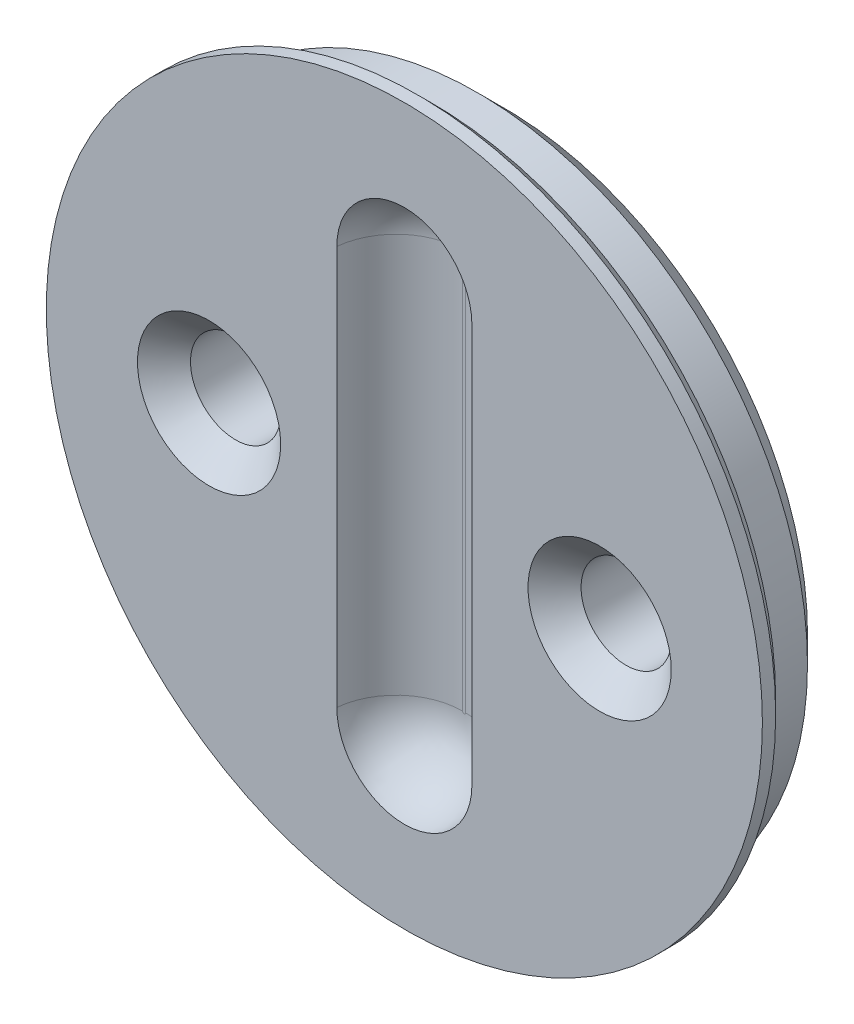
ISO-10303-21;
HEADER;
FILE_DESCRIPTION(('STEP AP214'),'2;1');
FILE_NAME('part.step','',(''),(''),'','','');
FILE_SCHEMA(('AUTOMOTIVE_DESIGN { 1 0 10303 214 1 1 1 1 }'));
ENDSEC;
DATA;
#1=APPLICATION_CONTEXT('core data for automotive mechanical design processes');
#2=APPLICATION_PROTOCOL_DEFINITION('international standard','automotive_design',2000,#1);
#3=PRODUCT_CONTEXT('',#1,'mechanical');
#4=PRODUCT('Part','Part','',(#3));
#5=PRODUCT_RELATED_PRODUCT_CATEGORY('part','',(#4));
#6=PRODUCT_DEFINITION_FORMATION('','',#4);
#7=PRODUCT_DEFINITION_CONTEXT('part definition',#1,'design');
#8=PRODUCT_DEFINITION('design','',#6,#7);
#9=PRODUCT_DEFINITION_SHAPE('','',#8);
#10=(LENGTH_UNIT() NAMED_UNIT(*) SI_UNIT(.MILLI.,.METRE.));
#11=(NAMED_UNIT(*) PLANE_ANGLE_UNIT() SI_UNIT($,.RADIAN.));
#12=(NAMED_UNIT(*) SI_UNIT($,.STERADIAN.) SOLID_ANGLE_UNIT());
#13=UNCERTAINTY_MEASURE_WITH_UNIT(LENGTH_MEASURE(1.E-05),#10,'distance_accuracy_value','');
#14=(GEOMETRIC_REPRESENTATION_CONTEXT(3) GLOBAL_UNCERTAINTY_ASSIGNED_CONTEXT((#13)) GLOBAL_UNIT_ASSIGNED_CONTEXT((#10,
#11,#12)) REPRESENTATION_CONTEXT('',''));
#15=CARTESIAN_POINT('',(0.,0.,0.));
#16=DIRECTION('',(0.,0.,1.));
#17=DIRECTION('',(1.,0.,0.));
#18=AXIS2_PLACEMENT_3D('',#15,#16,#17);
#19=CARTESIAN_POINT('',(0.,0.,-2.75));
#20=DIRECTION('',(0.,0.,1.));
#21=DIRECTION('',(1.,0.,0.));
#22=AXIS2_PLACEMENT_3D('',#19,#20,#21);
#23=PLANE('',#22);
#24=CARTESIAN_POINT('',(0.,0.,-2.75));
#25=DIRECTION('',(0.,0.,1.));
#26=DIRECTION('',(1.,0.,0.));
#27=AXIS2_PLACEMENT_3D('',#24,#25,#26);
#28=CIRCLE('',#27,11.45);
#29=CARTESIAN_POINT('',(11.45,0.,-2.75));
#30=VERTEX_POINT('',#29);
#31=EDGE_CURVE('E208',#30,#30,#28,.F.);
#32=ORIENTED_EDGE('',*,*,#31,.T.);
#33=EDGE_LOOP('',(#32));
#34=FACE_BOUND('',#33,.T.);
#35=CARTESIAN_POINT('',(-7.36300717,0.,-2.75));
#36=DIRECTION('',(0.,0.,1.));
#37=DIRECTION('',(1.,0.,0.));
#38=AXIS2_PLACEMENT_3D('',#35,#36,#37);
#39=CIRCLE('',#38,1.7);
#40=CARTESIAN_POINT('',(-5.66300717,0.,-2.75));
#41=VERTEX_POINT('',#40);
#42=EDGE_CURVE('E175',#41,#41,#39,.T.);
#43=ORIENTED_EDGE('',*,*,#42,.T.);
#44=EDGE_LOOP('',(#43));
#45=FACE_BOUND('',#44,.T.);
#46=CARTESIAN_POINT('',(7.36300717,0.,-2.75));
#47=DIRECTION('',(0.,0.,1.));
#48=DIRECTION('',(-1.,0.,0.));
#49=AXIS2_PLACEMENT_3D('',#46,#47,#48);
#50=CIRCLE('',#49,1.7);
#51=CARTESIAN_POINT('',(5.66300717,0.,-2.75));
#52=VERTEX_POINT('',#51);
#53=EDGE_CURVE('E173',#52,#52,#50,.T.);
#54=ORIENTED_EDGE('',*,*,#53,.T.);
#55=EDGE_LOOP('',(#54));
#56=FACE_BOUND('',#55,.T.);
#57=DIRECTION('',(0.,1.,0.));
#58=VECTOR('',#57,1.);
#59=CARTESIAN_POINT('',(-3.85,3.35,-2.75));
#60=LINE('',#59,#58);
#61=CARTESIAN_POINT('',(-3.85,-3.35,-2.75));
#62=VERTEX_POINT('',#61);
#63=CARTESIAN_POINT('',(-3.85,3.35,-2.75));
#64=VERTEX_POINT('',#63);
#65=EDGE_CURVE('E239',#62,#64,#60,.T.);
#66=ORIENTED_EDGE('',*,*,#65,.F.);
#67=DIRECTION('',(-1.,0.,0.));
#68=VECTOR('',#67,1.);
#69=CARTESIAN_POINT('',(3.85,-3.35,-2.75));
#70=LINE('',#69,#68);
#71=CARTESIAN_POINT('',(3.85,-3.35,-2.75));
#72=VERTEX_POINT('',#71);
#73=EDGE_CURVE('E248',#72,#62,#70,.T.);
#74=ORIENTED_EDGE('',*,*,#73,.F.);
#75=DIRECTION('',(0.,-1.,0.));
#76=VECTOR('',#75,1.);
#77=CARTESIAN_POINT('',(3.85,3.35,-2.75));
#78=LINE('',#77,#76);
#79=CARTESIAN_POINT('',(3.85,3.35,-2.75));
#80=VERTEX_POINT('',#79);
#81=EDGE_CURVE('E245',#80,#72,#78,.T.);
#82=ORIENTED_EDGE('',*,*,#81,.F.);
#83=DIRECTION('',(1.,0.,0.));
#84=VECTOR('',#83,1.);
#85=CARTESIAN_POINT('',(3.85,3.35,-2.75));
#86=LINE('',#85,#84);
#87=EDGE_CURVE('E242',#64,#80,#86,.T.);
#88=ORIENTED_EDGE('',*,*,#87,.F.);
#89=EDGE_LOOP('',(#66,#74,#82,#88));
#90=FACE_BOUND('',#89,.T.);
#91=ADVANCED_FACE('F38',(#34,#45,#56,#90),#23,.F.);
#92=CARTESIAN_POINT('',(0.,0.,-2.75));
#93=DIRECTION('',(0.,0.,1.));
#94=DIRECTION('',(1.,0.,0.));
#95=AXIS2_PLACEMENT_3D('',#92,#93,#94);
#96=CYLINDRICAL_SURFACE('',#95,12.45);
#97=CARTESIAN_POINT('',(0.,0.,-1.75));
#98=DIRECTION('',(0.,0.,1.));
#99=DIRECTION('',(1.,0.,0.));
#100=AXIS2_PLACEMENT_3D('',#97,#98,#99);
#101=CIRCLE('',#100,12.45);
#102=CARTESIAN_POINT('',(12.45,0.,-1.75));
#103=VERTEX_POINT('',#102);
#104=EDGE_CURVE('E205',#103,#103,#101,.T.);
#105=ORIENTED_EDGE('',*,*,#104,.T.);
#106=EDGE_LOOP('',(#105));
#107=FACE_BOUND('',#106,.T.);
#108=CARTESIAN_POINT('',(0.,0.,0.));
#109=DIRECTION('',(0.,0.,1.));
#110=DIRECTION('',(1.,0.,0.));
#111=AXIS2_PLACEMENT_3D('',#108,#109,#110);
#112=CIRCLE('',#111,12.45);
#113=CARTESIAN_POINT('',(12.45,0.,0.));
#114=VERTEX_POINT('',#113);
#115=EDGE_CURVE('E179',#114,#114,#112,.T.);
#116=ORIENTED_EDGE('',*,*,#115,.F.);
#117=EDGE_LOOP('',(#116));
#118=FACE_BOUND('',#117,.T.);
#119=ADVANCED_FACE('F303',(#107,#118),#96,.T.);
#120=CARTESIAN_POINT('',(-7.36300717,0.,-2.75));
#121=DIRECTION('',(0.,0.,1.));
#122=DIRECTION('',(1.,0.,0.));
#123=AXIS2_PLACEMENT_3D('',#120,#121,#122);
#124=CYLINDRICAL_SURFACE('',#123,1.7);
#125=CARTESIAN_POINT('',(-7.36300717,0.,0.));
#126=DIRECTION('',(0.,0.,1.));
#127=DIRECTION('',(1.,0.,0.));
#128=AXIS2_PLACEMENT_3D('',#125,#126,#127);
#129=CIRCLE('',#128,1.7);
#130=CARTESIAN_POINT('',(-5.66300717,0.,0.));
#131=VERTEX_POINT('',#130);
#132=EDGE_CURVE('E11',#131,#131,#129,.T.);
#133=ORIENTED_EDGE('',*,*,#132,.T.);
#134=EDGE_LOOP('',(#133));
#135=FACE_BOUND('',#134,.T.);
#136=ORIENTED_EDGE('',*,*,#42,.F.);
#137=EDGE_LOOP('',(#136));
#138=FACE_BOUND('',#137,.T.);
#139=ADVANCED_FACE('F169',(#135,#138),#124,.F.);
#140=CARTESIAN_POINT('',(7.36300717,0.,-2.75));
#141=DIRECTION('',(0.,0.,1.));
#142=DIRECTION('',(1.,0.,0.));
#143=AXIS2_PLACEMENT_3D('',#140,#141,#142);
#144=CYLINDRICAL_SURFACE('',#143,1.7);
#145=CARTESIAN_POINT('',(7.36300717,0.,0.));
#146=DIRECTION('',(0.,0.,1.));
#147=DIRECTION('',(1.,0.,0.));
#148=AXIS2_PLACEMENT_3D('',#145,#146,#147);
#149=CIRCLE('',#148,1.7);
#150=CARTESIAN_POINT('',(9.06300717,0.,0.));
#151=VERTEX_POINT('',#150);
#152=EDGE_CURVE('E150',#151,#151,#149,.T.);
#153=ORIENTED_EDGE('',*,*,#152,.T.);
#154=EDGE_LOOP('',(#153));
#155=FACE_BOUND('',#154,.T.);
#156=ORIENTED_EDGE('',*,*,#53,.F.);
#157=EDGE_LOOP('',(#156));
#158=FACE_BOUND('',#157,.T.);
#159=ADVANCED_FACE('F165',(#155,#158),#144,.F.);
#160=CARTESIAN_POINT('',(-3.85,3.35,-6.25));
#161=DIRECTION('',(1.,0.,0.));
#162=DIRECTION('',(0.,1.,0.));
#163=AXIS2_PLACEMENT_3D('',#160,#161,#162);
#164=PLANE('',#163);
#165=DIRECTION('',(0.,0.,1.));
#166=VECTOR('',#165,1.);
#167=CARTESIAN_POINT('',(-3.85,3.35,-6.25));
#168=LINE('',#167,#166);
#169=CARTESIAN_POINT('',(-3.85,3.35,-5.25));
#170=VERTEX_POINT('',#169);
#171=EDGE_CURVE('E176',#170,#64,#168,.T.);
#172=ORIENTED_EDGE('',*,*,#171,.F.);
#173=DIRECTION('',(0.,-1.,0.));
#174=VECTOR('',#173,1.);
#175=CARTESIAN_POINT('',(-3.85,-3.35,-5.25));
#176=LINE('',#175,#174);
#177=CARTESIAN_POINT('',(-3.85,-3.35,-5.25));
#178=VERTEX_POINT('',#177);
#179=EDGE_CURVE('E203',#170,#178,#176,.T.);
#180=ORIENTED_EDGE('',*,*,#179,.T.);
#181=DIRECTION('',(0.,0.,1.));
#182=VECTOR('',#181,1.);
#183=CARTESIAN_POINT('',(-3.85,-3.35,-6.25));
#184=LINE('',#183,#182);
#185=EDGE_CURVE('E251',#178,#62,#184,.T.);
#186=ORIENTED_EDGE('',*,*,#185,.T.);
#187=ORIENTED_EDGE('',*,*,#65,.T.);
#188=EDGE_LOOP('',(#172,#180,#186,#187));
#189=FACE_BOUND('',#188,.T.);
#190=ADVANCED_FACE('F168',(#189),#164,.F.);
#191=CARTESIAN_POINT('',(3.85,3.35,-6.25));
#192=DIRECTION('',(0.,-1.,0.));
#193=DIRECTION('',(0.,0.,-1.));
#194=AXIS2_PLACEMENT_3D('',#191,#192,#193);
#195=PLANE('',#194);
#196=DIRECTION('',(0.,0.,1.));
#197=VECTOR('',#196,1.);
#198=CARTESIAN_POINT('',(3.85,3.35,-6.25));
#199=LINE('',#198,#197);
#200=CARTESIAN_POINT('',(3.85,3.35,-5.25));
#201=VERTEX_POINT('',#200);
#202=EDGE_CURVE('E181',#201,#80,#199,.T.);
#203=ORIENTED_EDGE('',*,*,#202,.F.);
#204=DIRECTION('',(-1.,0.,0.));
#205=VECTOR('',#204,1.);
#206=CARTESIAN_POINT('',(-3.85,3.35,-5.25));
#207=LINE('',#206,#205);
#208=EDGE_CURVE('E196',#201,#170,#207,.T.);
#209=ORIENTED_EDGE('',*,*,#208,.T.);
#210=ORIENTED_EDGE('',*,*,#171,.T.);
#211=ORIENTED_EDGE('',*,*,#87,.T.);
#212=EDGE_LOOP('',(#203,#209,#210,#211));
#213=FACE_BOUND('',#212,.T.);
#214=ADVANCED_FACE('F266',(#213),#195,.F.);
#215=CARTESIAN_POINT('',(3.85,3.35,-6.25));
#216=DIRECTION('',(-1.,0.,0.));
#217=DIRECTION('',(0.,-1.,0.));
#218=AXIS2_PLACEMENT_3D('',#215,#216,#217);
#219=PLANE('',#218);
#220=DIRECTION('',(0.,0.,1.));
#221=VECTOR('',#220,1.);
#222=CARTESIAN_POINT('',(3.85,-3.35,-6.25));
#223=LINE('',#222,#221);
#224=CARTESIAN_POINT('',(3.85,-3.35,-5.25));
#225=VERTEX_POINT('',#224);
#226=EDGE_CURVE('E253',#225,#72,#223,.T.);
#227=ORIENTED_EDGE('',*,*,#226,.F.);
#228=DIRECTION('',(0.,1.,0.));
#229=VECTOR('',#228,1.);
#230=CARTESIAN_POINT('',(3.85,3.35,-5.25));
#231=LINE('',#230,#229);
#232=EDGE_CURVE('E199',#225,#201,#231,.T.);
#233=ORIENTED_EDGE('',*,*,#232,.T.);
#234=ORIENTED_EDGE('',*,*,#202,.T.);
#235=ORIENTED_EDGE('',*,*,#81,.T.);
#236=EDGE_LOOP('',(#227,#233,#234,#235));
#237=FACE_BOUND('',#236,.T.);
#238=ADVANCED_FACE('F258',(#237),#219,.F.);
#239=CARTESIAN_POINT('',(3.85,-3.35,-6.25));
#240=DIRECTION('',(0.,1.,0.));
#241=DIRECTION('',(0.,0.,1.));
#242=AXIS2_PLACEMENT_3D('',#239,#240,#241);
#243=PLANE('',#242);
#244=ORIENTED_EDGE('',*,*,#185,.F.);
#245=DIRECTION('',(1.,0.,0.));
#246=VECTOR('',#245,1.);
#247=CARTESIAN_POINT('',(3.85,-3.35,-5.25));
#248=LINE('',#247,#246);
#249=EDGE_CURVE('E201',#178,#225,#248,.T.);
#250=ORIENTED_EDGE('',*,*,#249,.T.);
#251=ORIENTED_EDGE('',*,*,#226,.T.);
#252=ORIENTED_EDGE('',*,*,#73,.T.);
#253=EDGE_LOOP('',(#244,#250,#251,#252));
#254=FACE_BOUND('',#253,.T.);
#255=ADVANCED_FACE('F272',(#254),#243,.F.);
#256=CARTESIAN_POINT('',(0.,0.,-6.25));
#257=DIRECTION('',(0.,0.,-1.));
#258=DIRECTION('',(-1.,0.,0.));
#259=AXIS2_PLACEMENT_3D('',#256,#257,#258);
#260=PLANE('',#259);
#261=DIRECTION('',(0.,1.,0.));
#262=VECTOR('',#261,1.);
#263=CARTESIAN_POINT('',(-2.85,3.35,-6.25));
#264=LINE('',#263,#262);
#265=CARTESIAN_POINT('',(-2.85,-2.35,-6.25));
#266=VERTEX_POINT('',#265);
#267=CARTESIAN_POINT('',(-2.85,2.35,-6.25));
#268=VERTEX_POINT('',#267);
#269=EDGE_CURVE('E187',#266,#268,#264,.T.);
#270=ORIENTED_EDGE('',*,*,#269,.T.);
#271=DIRECTION('',(1.,0.,0.));
#272=VECTOR('',#271,1.);
#273=CARTESIAN_POINT('',(3.85,2.35,-6.25));
#274=LINE('',#273,#272);
#275=CARTESIAN_POINT('',(2.85,2.35,-6.25));
#276=VERTEX_POINT('',#275);
#277=EDGE_CURVE('E193',#268,#276,#274,.T.);
#278=ORIENTED_EDGE('',*,*,#277,.T.);
#279=DIRECTION('',(0.,-1.,0.));
#280=VECTOR('',#279,1.);
#281=CARTESIAN_POINT('',(2.85,-3.35,-6.25));
#282=LINE('',#281,#280);
#283=CARTESIAN_POINT('',(2.85,-2.35,-6.25));
#284=VERTEX_POINT('',#283);
#285=EDGE_CURVE('E191',#276,#284,#282,.T.);
#286=ORIENTED_EDGE('',*,*,#285,.T.);
#287=DIRECTION('',(-1.,0.,0.));
#288=VECTOR('',#287,1.);
#289=CARTESIAN_POINT('',(-3.85,-2.35,-6.25));
#290=LINE('',#289,#288);
#291=EDGE_CURVE('E189',#284,#266,#290,.T.);
#292=ORIENTED_EDGE('',*,*,#291,.T.);
#293=EDGE_LOOP('',(#270,#278,#286,#292));
#294=FACE_BOUND('',#293,.T.);
#295=ADVANCED_FACE('F291',(#294),#260,.T.);
#296=CARTESIAN_POINT('',(0.,0.,1.));
#297=DIRECTION('',(0.,0.,1.));
#298=DIRECTION('',(1.,0.,0.));
#299=AXIS2_PLACEMENT_3D('',#296,#297,#298);
#300=PLANE('',#299);
#301=CARTESIAN_POINT('',(7.36300717,0.,1.));
#302=DIRECTION('',(0.,0.,1.));
#303=DIRECTION('',(1.,0.,0.));
#304=AXIS2_PLACEMENT_3D('',#301,#302,#303);
#305=CIRCLE('',#304,2.7);
#306=CARTESIAN_POINT('',(10.06300717,0.,1.));
#307=VERTEX_POINT('',#306);
#308=EDGE_CURVE('E47',#307,#307,#305,.F.);
#309=ORIENTED_EDGE('',*,*,#308,.T.);
#310=EDGE_LOOP('',(#309));
#311=FACE_BOUND('',#310,.T.);
#312=CARTESIAN_POINT('',(-7.36300717,0.,1.));
#313=DIRECTION('',(0.,0.,1.));
#314=DIRECTION('',(1.,0.,0.));
#315=AXIS2_PLACEMENT_3D('',#312,#313,#314);
#316=CIRCLE('',#315,2.70000000000001);
#317=CARTESIAN_POINT('',(-4.66300716999999,0.,1.));
#318=VERTEX_POINT('',#317);
#319=EDGE_CURVE('E153',#318,#318,#316,.F.);
#320=ORIENTED_EDGE('',*,*,#319,.T.);
#321=EDGE_LOOP('',(#320));
#322=FACE_BOUND('',#321,.T.);
#323=CARTESIAN_POINT('',(0.,7.52566159556163,1.));
#324=DIRECTION('',(0.,0.,1.));
#325=DIRECTION('',(1.,0.,0.));
#326=AXIS2_PLACEMENT_3D('',#323,#324,#325);
#327=CIRCLE('',#326,2.54627647970131);
#328=CARTESIAN_POINT('',(2.54627647970131,7.52566159556163,1.));
#329=VERTEX_POINT('',#328);
#330=CARTESIAN_POINT('',(-2.54627647970131,7.52566159556163,1.));
#331=VERTEX_POINT('',#330);
#332=EDGE_CURVE('E135',#329,#331,#327,.T.);
#333=ORIENTED_EDGE('',*,*,#332,.F.);
#334=DIRECTION('',(0.,1.,0.));
#335=VECTOR('',#334,1.);
#336=CARTESIAN_POINT('',(2.54627647970131,7.52566159556163,1.));
#337=LINE('',#336,#335);
#338=CARTESIAN_POINT('',(2.54627647970131,-7.52566159556163,1.));
#339=VERTEX_POINT('',#338);
#340=EDGE_CURVE('E122',#339,#329,#337,.T.);
#341=ORIENTED_EDGE('',*,*,#340,.F.);
#342=CARTESIAN_POINT('',(0.,-7.52566159556163,1.));
#343=DIRECTION('',(0.,0.,1.));
#344=DIRECTION('',(1.,0.,0.));
#345=AXIS2_PLACEMENT_3D('',#342,#343,#344);
#346=CIRCLE('',#345,2.54627647970131);
#347=CARTESIAN_POINT('',(-2.54627647970131,-7.52566159556163,1.));
#348=VERTEX_POINT('',#347);
#349=EDGE_CURVE('E116',#348,#339,#346,.T.);
#350=ORIENTED_EDGE('',*,*,#349,.F.);
#351=DIRECTION('',(0.,-1.,0.));
#352=VECTOR('',#351,1.);
#353=CARTESIAN_POINT('',(-2.54627647970131,7.52566159556163,1.));
#354=LINE('',#353,#352);
#355=EDGE_CURVE('E120',#331,#348,#354,.T.);
#356=ORIENTED_EDGE('',*,*,#355,.F.);
#357=EDGE_LOOP('',(#333,#341,#350,#356));
#358=FACE_BOUND('',#357,.T.);
#359=CARTESIAN_POINT('',(0.,0.,1.));
#360=DIRECTION('',(0.,0.,1.));
#361=DIRECTION('',(1.,0.,0.));
#362=AXIS2_PLACEMENT_3D('',#359,#360,#361);
#363=CIRCLE('',#362,13.5);
#364=CARTESIAN_POINT('',(13.5,0.,1.));
#365=VERTEX_POINT('',#364);
#366=EDGE_CURVE('E222',#365,#365,#363,.T.);
#367=ORIENTED_EDGE('',*,*,#366,.T.);
#368=EDGE_LOOP('',(#367));
#369=FACE_BOUND('',#368,.T.);
#370=ADVANCED_FACE('F118',(#311,#322,#358,#369),#300,.T.);
#371=CARTESIAN_POINT('',(0.,0.,0.));
#372=DIRECTION('',(0.,0.,1.));
#373=DIRECTION('',(1.,0.,0.));
#374=AXIS2_PLACEMENT_3D('',#371,#372,#373);
#375=PLANE('',#374);
#376=CARTESIAN_POINT('',(0.,0.,0.));
#377=DIRECTION('',(0.,0.,1.));
#378=DIRECTION('',(1.,0.,0.));
#379=AXIS2_PLACEMENT_3D('',#376,#377,#378);
#380=CIRCLE('',#379,13.);
#381=CARTESIAN_POINT('',(13.,0.,0.));
#382=VERTEX_POINT('',#381);
#383=EDGE_CURVE('E225',#382,#382,#380,.F.);
#384=ORIENTED_EDGE('',*,*,#383,.T.);
#385=EDGE_LOOP('',(#384));
#386=FACE_BOUND('',#385,.T.);
#387=ORIENTED_EDGE('',*,*,#115,.T.);
#388=EDGE_LOOP('',(#387));
#389=FACE_BOUND('',#388,.T.);
#390=ADVANCED_FACE('F298',(#386,#389),#375,.F.);
#391=CARTESIAN_POINT('',(0.,0.,1.));
#392=DIRECTION('',(0.,0.,-1.));
#393=DIRECTION('',(-1.,0.,0.));
#394=AXIS2_PLACEMENT_3D('',#391,#392,#393);
#395=CYLINDRICAL_SURFACE('',#394,13.5);
#396=CARTESIAN_POINT('',(0.,0.,0.500000000000004));
#397=DIRECTION('',(0.,0.,1.));
#398=DIRECTION('',(1.,0.,0.));
#399=AXIS2_PLACEMENT_3D('',#396,#397,#398);
#400=CIRCLE('',#399,13.5);
#401=CARTESIAN_POINT('',(13.5,0.,0.500000000000004));
#402=VERTEX_POINT('',#401);
#403=EDGE_CURVE('E211',#402,#402,#400,.T.);
#404=ORIENTED_EDGE('',*,*,#403,.T.);
#405=EDGE_LOOP('',(#404));
#406=FACE_BOUND('',#405,.T.);
#407=ORIENTED_EDGE('',*,*,#366,.F.);
#408=EDGE_LOOP('',(#407));
#409=FACE_BOUND('',#408,.T.);
#410=ADVANCED_FACE('F336',(#406,#409),#395,.T.);
#411=CARTESIAN_POINT('',(0.,-2.35,-6.25));
#412=DIRECTION('',(0.,-0.70710678118655,-0.707106781186545));
#413=DIRECTION('',(1.,0.,0.));
#414=AXIS2_PLACEMENT_3D('',#411,#412,#413);
#415=PLANE('',#414);
#416=DIRECTION('',(0.577350269189624,-0.577350269189624,0.577350269189629));
#417=VECTOR('',#416,1.);
#418=CARTESIAN_POINT('',(1.90000000000001,-1.40000000000001,-7.2));
#419=LINE('',#418,#417);
#420=EDGE_CURVE('E216',#225,#284,#419,.F.);
#421=ORIENTED_EDGE('',*,*,#420,.F.);
#422=ORIENTED_EDGE('',*,*,#249,.F.);
#423=DIRECTION('',(-0.577350269189625,-0.577350269189624,0.577350269189629));
#424=VECTOR('',#423,1.);
#425=CARTESIAN_POINT('',(-2.06666666666667,-1.56666666666667,-7.03333333333334));
#426=LINE('',#425,#424);
#427=EDGE_CURVE('E219',#266,#178,#426,.T.);
#428=ORIENTED_EDGE('',*,*,#427,.F.);
#429=ORIENTED_EDGE('',*,*,#291,.F.);
#430=EDGE_LOOP('',(#421,#422,#428,#429));
#431=FACE_BOUND('',#430,.T.);
#432=ADVANCED_FACE('F277',(#431),#415,.T.);
#433=CARTESIAN_POINT('',(-2.85,0.,-6.25));
#434=DIRECTION('',(-0.70710678118655,0.,-0.707106781186545));
#435=DIRECTION('',(0.,-1.,0.));
#436=AXIS2_PLACEMENT_3D('',#433,#434,#435);
#437=PLANE('',#436);
#438=ORIENTED_EDGE('',*,*,#427,.T.);
#439=ORIENTED_EDGE('',*,*,#179,.F.);
#440=DIRECTION('',(0.577350269189624,-0.577350269189624,-0.577350269189629));
#441=VECTOR('',#440,1.);
#442=CARTESIAN_POINT('',(-2.06666666666667,1.56666666666667,-7.03333333333334));
#443=LINE('',#442,#441);
#444=EDGE_CURVE('E214',#268,#170,#443,.F.);
#445=ORIENTED_EDGE('',*,*,#444,.F.);
#446=ORIENTED_EDGE('',*,*,#269,.F.);
#447=EDGE_LOOP('',(#438,#439,#445,#446));
#448=FACE_BOUND('',#447,.T.);
#449=ADVANCED_FACE('F289',(#448),#437,.T.);
#450=CARTESIAN_POINT('',(2.85,0.,-6.25));
#451=DIRECTION('',(0.70710678118655,0.,-0.707106781186545));
#452=DIRECTION('',(0.,1.,0.));
#453=AXIS2_PLACEMENT_3D('',#450,#451,#452);
#454=PLANE('',#453);
#455=ORIENTED_EDGE('',*,*,#420,.T.);
#456=ORIENTED_EDGE('',*,*,#285,.F.);
#457=DIRECTION('',(0.577350269189625,0.577350269189624,0.577350269189629));
#458=VECTOR('',#457,1.);
#459=CARTESIAN_POINT('',(2.06666666666667,1.56666666666667,-7.03333333333334));
#460=LINE('',#459,#458);
#461=EDGE_CURVE('E212',#201,#276,#460,.F.);
#462=ORIENTED_EDGE('',*,*,#461,.F.);
#463=ORIENTED_EDGE('',*,*,#232,.F.);
#464=EDGE_LOOP('',(#455,#456,#462,#463));
#465=FACE_BOUND('',#464,.T.);
#466=ADVANCED_FACE('F282',(#465),#454,.T.);
#467=CARTESIAN_POINT('',(0.,2.35,-6.25));
#468=DIRECTION('',(0.,0.70710678118655,-0.707106781186545));
#469=DIRECTION('',(-1.,0.,0.));
#470=AXIS2_PLACEMENT_3D('',#467,#468,#469);
#471=PLANE('',#470);
#472=ORIENTED_EDGE('',*,*,#444,.T.);
#473=ORIENTED_EDGE('',*,*,#208,.F.);
#474=ORIENTED_EDGE('',*,*,#461,.T.);
#475=ORIENTED_EDGE('',*,*,#277,.F.);
#476=EDGE_LOOP('',(#472,#473,#474,#475));
#477=FACE_BOUND('',#476,.T.);
#478=ADVANCED_FACE('F285',(#477),#471,.T.);
#479=CARTESIAN_POINT('',(0.,0.,-1.75));
#480=DIRECTION('',(0.,0.,1.));
#481=DIRECTION('',(1.,0.,0.));
#482=AXIS2_PLACEMENT_3D('',#479,#480,#481);
#483=CONICAL_SURFACE('',#482,12.45,0.78539816339745);
#484=ORIENTED_EDGE('',*,*,#31,.F.);
#485=EDGE_LOOP('',(#484));
#486=FACE_BOUND('',#485,.T.);
#487=ORIENTED_EDGE('',*,*,#104,.F.);
#488=EDGE_LOOP('',(#487));
#489=FACE_BOUND('',#488,.T.);
#490=ADVANCED_FACE('F321',(#486,#489),#483,.T.);
#491=CARTESIAN_POINT('',(0.,0.,0.500000000000004));
#492=DIRECTION('',(0.,0.,1.));
#493=DIRECTION('',(1.,0.,0.));
#494=AXIS2_PLACEMENT_3D('',#491,#492,#493);
#495=CONICAL_SURFACE('',#494,13.5,0.785398163397452);
#496=ORIENTED_EDGE('',*,*,#383,.F.);
#497=EDGE_LOOP('',(#496));
#498=FACE_BOUND('',#497,.T.);
#499=ORIENTED_EDGE('',*,*,#403,.F.);
#500=EDGE_LOOP('',(#499));
#501=FACE_BOUND('',#500,.T.);
#502=ADVANCED_FACE('F342',(#498,#501),#495,.T.);
#503=CARTESIAN_POINT('',(0.,7.52566159556163,-1.25));
#504=DIRECTION('',(0.,0.,1.));
#505=DIRECTION('',(1.,0.,0.));
#506=AXIS2_PLACEMENT_3D('',#503,#504,#505);
#507=PLANE('',#506);
#508=CARTESIAN_POINT('',(0.,7.52566159556163,-1.25));
#509=DIRECTION('',(0.,0.,1.));
#510=DIRECTION('',(1.,0.,0.));
#511=AXIS2_PLACEMENT_3D('',#508,#509,#510);
#512=CIRCLE('',#511,0.0588078869347636);
#513=CARTESIAN_POINT('',(0.0588078869347636,7.52566159556163,-1.25));
#514=VERTEX_POINT('',#513);
#515=CARTESIAN_POINT('',(-0.0588078869347636,7.52566159556163,-1.25));
#516=VERTEX_POINT('',#515);
#517=EDGE_CURVE('E54',#514,#516,#512,.T.);
#518=ORIENTED_EDGE('',*,*,#517,.T.);
#519=DIRECTION('',(0.,-1.,0.));
#520=VECTOR('',#519,1.);
#521=CARTESIAN_POINT('',(-0.0588078869347636,-7.52566159556163,-1.25));
#522=LINE('',#521,#520);
#523=CARTESIAN_POINT('',(-0.0588078869347636,-7.52566159556163,-1.25));
#524=VERTEX_POINT('',#523);
#525=EDGE_CURVE('E143',#516,#524,#522,.T.);
#526=ORIENTED_EDGE('',*,*,#525,.T.);
#527=CARTESIAN_POINT('',(0.,-7.52566159556163,-1.25));
#528=DIRECTION('',(0.,0.,1.));
#529=DIRECTION('',(1.,0.,0.));
#530=AXIS2_PLACEMENT_3D('',#527,#528,#529);
#531=CIRCLE('',#530,0.0588078869347636);
#532=CARTESIAN_POINT('',(0.0588078869347636,-7.52566159556163,-1.25));
#533=VERTEX_POINT('',#532);
#534=EDGE_CURVE('E138',#524,#533,#531,.T.);
#535=ORIENTED_EDGE('',*,*,#534,.T.);
#536=DIRECTION('',(0.,1.,0.));
#537=VECTOR('',#536,1.);
#538=CARTESIAN_POINT('',(0.0588078869347636,7.52566159556163,-1.25));
#539=LINE('',#538,#537);
#540=EDGE_CURVE('E59',#533,#514,#539,.T.);
#541=ORIENTED_EDGE('',*,*,#540,.T.);
#542=EDGE_LOOP('',(#518,#526,#535,#541));
#543=FACE_BOUND('',#542,.T.);
#544=ADVANCED_FACE('F229',(#543),#507,.T.);
#545=CARTESIAN_POINT('',(0.0588078869347636,7.52566159556163,1.25));
#546=DIRECTION('',(0.,-1.,0.));
#547=DIRECTION('',(0.,0.,-1.));
#548=AXIS2_PLACEMENT_3D('',#545,#546,#547);
#549=CYLINDRICAL_SURFACE('',#548,2.5);
#550=CARTESIAN_POINT('',(0.0588078869347635,-7.52566159556163,1.25));
#551=DIRECTION('',(0.,1.,0.));
#552=DIRECTION('',(0.,0.,1.));
#553=AXIS2_PLACEMENT_3D('',#550,#551,#552);
#554=CIRCLE('',#553,2.5);
#555=EDGE_CURVE('E140',#339,#533,#554,.T.);
#556=ORIENTED_EDGE('',*,*,#555,.F.);
#557=ORIENTED_EDGE('',*,*,#340,.T.);
#558=CARTESIAN_POINT('',(0.0588078869347636,7.52566159556163,1.25));
#559=DIRECTION('',(0.,-1.,0.));
#560=DIRECTION('',(0.,0.,-1.));
#561=AXIS2_PLACEMENT_3D('',#558,#559,#560);
#562=CIRCLE('',#561,2.5);
#563=EDGE_CURVE('E147',#514,#329,#562,.T.);
#564=ORIENTED_EDGE('',*,*,#563,.F.);
#565=ORIENTED_EDGE('',*,*,#540,.F.);
#566=EDGE_LOOP('',(#556,#557,#564,#565));
#567=FACE_BOUND('',#566,.T.);
#568=ADVANCED_FACE('F231',(#567),#549,.F.);
#569=CARTESIAN_POINT('',(0.,7.52566159556163,1.25));
#570=DIRECTION('',(0.,0.,-1.));
#571=DIRECTION('',(-1.,0.,0.));
#572=AXIS2_PLACEMENT_3D('',#569,#570,#571);
#573=DEGENERATE_TOROIDAL_SURFACE('',#572,0.0588078869347636,2.5,.T.);
#574=ORIENTED_EDGE('',*,*,#563,.T.);
#575=ORIENTED_EDGE('',*,*,#332,.T.);
#576=CARTESIAN_POINT('',(-0.0588078869347636,7.52566159556163,1.25));
#577=DIRECTION('',(0.,1.,0.));
#578=DIRECTION('',(0.,0.,1.));
#579=AXIS2_PLACEMENT_3D('',#576,#577,#578);
#580=CIRCLE('',#579,2.5);
#581=EDGE_CURVE('E133',#516,#331,#580,.T.);
#582=ORIENTED_EDGE('',*,*,#581,.F.);
#583=ORIENTED_EDGE('',*,*,#517,.F.);
#584=EDGE_LOOP('',(#574,#575,#582,#583));
#585=FACE_BOUND('',#584,.T.);
#586=ADVANCED_FACE('F233',(#585),#573,.F.);
#587=CARTESIAN_POINT('',(0.,-7.52566159556163,1.25));
#588=DIRECTION('',(0.,0.,-1.));
#589=DIRECTION('',(-1.,0.,0.));
#590=AXIS2_PLACEMENT_3D('',#587,#588,#589);
#591=DEGENERATE_TOROIDAL_SURFACE('',#590,0.0588078869347636,2.5,.T.);
#592=ORIENTED_EDGE('',*,*,#555,.T.);
#593=ORIENTED_EDGE('',*,*,#534,.F.);
#594=CARTESIAN_POINT('',(-0.0588078869347635,-7.52566159556163,1.25));
#595=DIRECTION('',(0.,-1.,0.));
#596=DIRECTION('',(0.,0.,-1.));
#597=AXIS2_PLACEMENT_3D('',#594,#595,#596);
#598=CIRCLE('',#597,2.5);
#599=EDGE_CURVE('E131',#348,#524,#598,.T.);
#600=ORIENTED_EDGE('',*,*,#599,.F.);
#601=ORIENTED_EDGE('',*,*,#349,.T.);
#602=EDGE_LOOP('',(#592,#593,#600,#601));
#603=FACE_BOUND('',#602,.T.);
#604=ADVANCED_FACE('F137',(#603),#591,.F.);
#605=CARTESIAN_POINT('',(-0.0588078869347636,7.52566159556163,1.25));
#606=DIRECTION('',(0.,1.,0.));
#607=DIRECTION('',(0.,0.,1.));
#608=AXIS2_PLACEMENT_3D('',#605,#606,#607);
#609=CYLINDRICAL_SURFACE('',#608,2.5);
#610=ORIENTED_EDGE('',*,*,#581,.T.);
#611=ORIENTED_EDGE('',*,*,#355,.T.);
#612=ORIENTED_EDGE('',*,*,#599,.T.);
#613=ORIENTED_EDGE('',*,*,#525,.F.);
#614=EDGE_LOOP('',(#610,#611,#612,#613));
#615=FACE_BOUND('',#614,.T.);
#616=ADVANCED_FACE('F129',(#615),#609,.F.);
#617=CARTESIAN_POINT('',(7.36300717,0.,0.));
#618=DIRECTION('',(0.,0.,1.));
#619=DIRECTION('',(1.,0.,0.));
#620=AXIS2_PLACEMENT_3D('',#617,#618,#619);
#621=CONICAL_SURFACE('',#620,1.7,0.785398163397451);
#622=ORIENTED_EDGE('',*,*,#308,.F.);
#623=EDGE_LOOP('',(#622));
#624=FACE_BOUND('',#623,.T.);
#625=ORIENTED_EDGE('',*,*,#152,.F.);
#626=EDGE_LOOP('',(#625));
#627=FACE_BOUND('',#626,.T.);
#628=ADVANCED_FACE('F160',(#624,#627),#621,.F.);
#629=CARTESIAN_POINT('',(-7.36300717,0.,0.));
#630=DIRECTION('',(0.,0.,1.));
#631=DIRECTION('',(1.,0.,0.));
#632=AXIS2_PLACEMENT_3D('',#629,#630,#631);
#633=CONICAL_SURFACE('',#632,1.7,0.785398163397451);
#634=ORIENTED_EDGE('',*,*,#319,.F.);
#635=EDGE_LOOP('',(#634));
#636=FACE_BOUND('',#635,.T.);
#637=ORIENTED_EDGE('',*,*,#132,.F.);
#638=EDGE_LOOP('',(#637));
#639=FACE_BOUND('',#638,.T.);
#640=ADVANCED_FACE('F41',(#636,#639),#633,.F.);
#641=CLOSED_SHELL('',(#91,#119,#139,#159,#190,#214,#238,#255,#295,#370,#390,#410,#432,#449,#466,
#478,#490,#502,#544,#568,#586,#604,#616,#628,#640));
#642=MANIFOLD_SOLID_BREP('B2',#641);
#643=ADVANCED_BREP_SHAPE_REPRESENTATION('',(#18,#642),#14);
#644=SHAPE_DEFINITION_REPRESENTATION(#9,#643);
ENDSEC;
END-ISO-10303-21;
